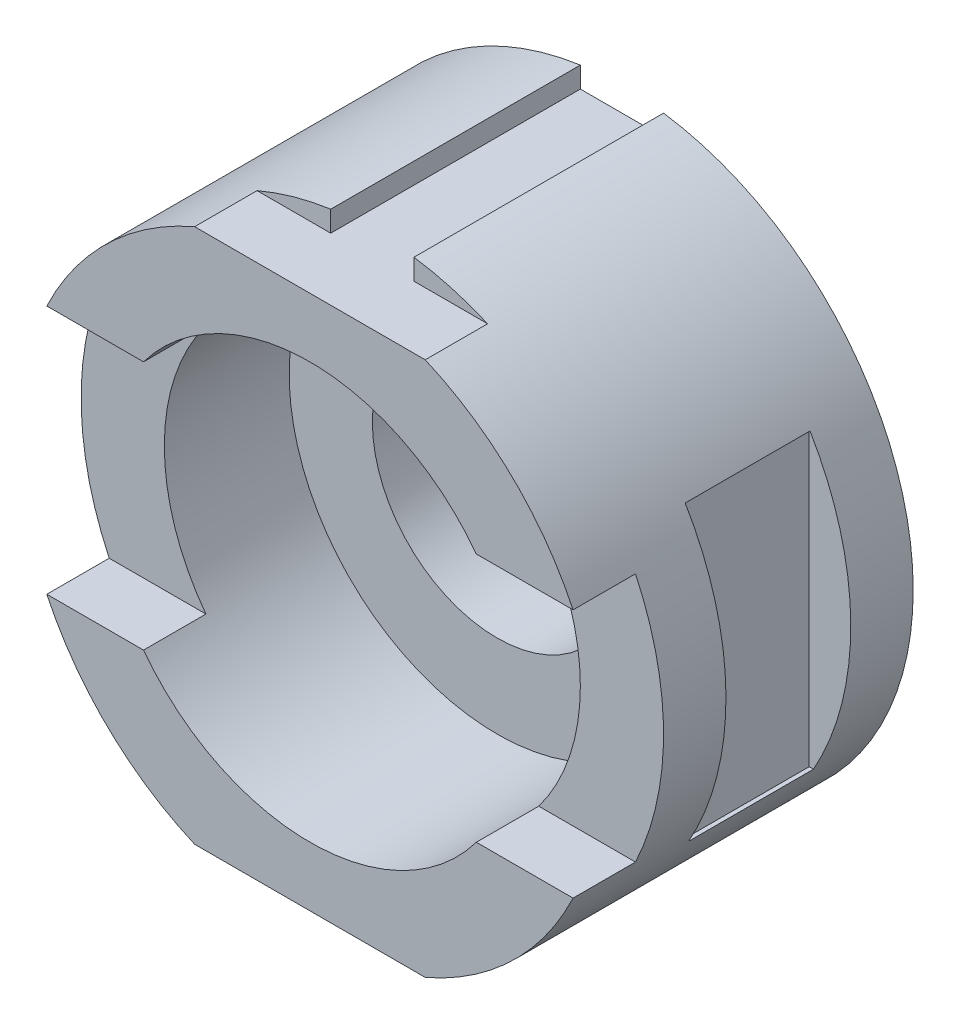
ISO-10303-21;
HEADER;
FILE_DESCRIPTION(('STEP AP214'),'2;1');
FILE_NAME('part.step','',(''),(''),'','','');
FILE_SCHEMA(('AUTOMOTIVE_DESIGN { 1 0 10303 214 1 1 1 1 }'));
ENDSEC;
DATA;
#1=APPLICATION_CONTEXT('core data for automotive mechanical design processes');
#2=APPLICATION_PROTOCOL_DEFINITION('international standard','automotive_design',2000,#1);
#3=PRODUCT_CONTEXT('',#1,'mechanical');
#4=PRODUCT('Part','Part','',(#3));
#5=PRODUCT_RELATED_PRODUCT_CATEGORY('part','',(#4));
#6=PRODUCT_DEFINITION_FORMATION('','',#4);
#7=PRODUCT_DEFINITION_CONTEXT('part definition',#1,'design');
#8=PRODUCT_DEFINITION('design','',#6,#7);
#9=PRODUCT_DEFINITION_SHAPE('','',#8);
#10=(LENGTH_UNIT() NAMED_UNIT(*) SI_UNIT(.MILLI.,.METRE.));
#11=(NAMED_UNIT(*) PLANE_ANGLE_UNIT() SI_UNIT($,.RADIAN.));
#12=(NAMED_UNIT(*) SI_UNIT($,.STERADIAN.) SOLID_ANGLE_UNIT());
#13=UNCERTAINTY_MEASURE_WITH_UNIT(LENGTH_MEASURE(1.E-05),#10,'distance_accuracy_value','');
#14=(GEOMETRIC_REPRESENTATION_CONTEXT(3) GLOBAL_UNCERTAINTY_ASSIGNED_CONTEXT((#13)) GLOBAL_UNIT_ASSIGNED_CONTEXT((#10,
#11,#12)) REPRESENTATION_CONTEXT('',''));
#15=CARTESIAN_POINT('',(0.,0.,0.));
#16=DIRECTION('',(0.,0.,1.));
#17=DIRECTION('',(1.,0.,0.));
#18=AXIS2_PLACEMENT_3D('',#15,#16,#17);
#19=CARTESIAN_POINT('',(0.,0.,0.));
#20=DIRECTION('',(0.,0.,1.));
#21=DIRECTION('',(1.,0.,0.));
#22=AXIS2_PLACEMENT_3D('',#19,#20,#21);
#23=CYLINDRICAL_SURFACE('',#22,30.);
#24=CARTESIAN_POINT('',(0.,0.,0.));
#25=DIRECTION('',(0.,0.,1.));
#26=DIRECTION('',(1.,0.,0.));
#27=AXIS2_PLACEMENT_3D('',#24,#25,#26);
#28=CIRCLE('',#27,30.);
#29=CARTESIAN_POINT('',(30.,0.,0.));
#30=VERTEX_POINT('',#29);
#31=EDGE_CURVE('E399',#30,#30,#28,.T.);
#32=ORIENTED_EDGE('',*,*,#31,.F.);
#33=EDGE_LOOP('',(#32));
#34=FACE_BOUND('',#33,.T.);
#35=CARTESIAN_POINT('',(0.,0.,30.));
#36=DIRECTION('',(0.,0.,1.));
#37=DIRECTION('',(1.,0.,0.));
#38=AXIS2_PLACEMENT_3D('',#35,#36,#37);
#39=CIRCLE('',#38,30.);
#40=CARTESIAN_POINT('',(30.,0.,30.));
#41=VERTEX_POINT('',#40);
#42=EDGE_CURVE('E61',#41,#41,#39,.F.);
#43=ORIENTED_EDGE('',*,*,#42,.F.);
#44=EDGE_LOOP('',(#43));
#45=FACE_BOUND('',#44,.T.);
#46=ADVANCED_FACE('F57',(#34,#45),#23,.F.);
#47=CARTESIAN_POINT('',(0.,-30.,60.));
#48=DIRECTION('',(0.,1.,0.));
#49=DIRECTION('',(-1.,0.,0.));
#50=AXIS2_PLACEMENT_3D('',#47,#48,#49);
#51=PLANE('',#50);
#52=DIRECTION('',(0.,0.,1.));
#53=VECTOR('',#52,1.);
#54=CARTESIAN_POINT('',(-40.,-30.,30.));
#55=LINE('',#54,#53);
#56=CARTESIAN_POINT('',(-40.,-30.,60.));
#57=VERTEX_POINT('',#56);
#58=CARTESIAN_POINT('',(-40.,-30.,75.));
#59=VERTEX_POINT('',#58);
#60=EDGE_CURVE('E572',#57,#59,#55,.T.);
#61=ORIENTED_EDGE('',*,*,#60,.F.);
#62=DIRECTION('',(-1.,0.,0.));
#63=VECTOR('',#62,1.);
#64=CARTESIAN_POINT('',(0.,-30.,60.));
#65=LINE('',#64,#63);
#66=CARTESIAN_POINT('',(-63.2455532033676,-30.,60.));
#67=VERTEX_POINT('',#66);
#68=EDGE_CURVE('E265',#57,#67,#65,.T.);
#69=ORIENTED_EDGE('',*,*,#68,.T.);
#70=DIRECTION('',(0.,0.,1.));
#71=VECTOR('',#70,1.);
#72=CARTESIAN_POINT('',(-63.2455532033676,-30.,60.));
#73=LINE('',#72,#71);
#74=CARTESIAN_POINT('',(-63.2455532033676,-30.,75.));
#75=VERTEX_POINT('',#74);
#76=EDGE_CURVE('E273',#67,#75,#73,.T.);
#77=ORIENTED_EDGE('',*,*,#76,.T.);
#78=DIRECTION('',(-1.,0.,0.));
#79=VECTOR('',#78,1.);
#80=CARTESIAN_POINT('',(0.,-30.,75.));
#81=LINE('',#80,#79);
#82=EDGE_CURVE('E524',#59,#75,#81,.T.);
#83=ORIENTED_EDGE('',*,*,#82,.F.);
#84=EDGE_LOOP('',(#61,#69,#77,#83));
#85=FACE_BOUND('',#84,.T.);
#86=ADVANCED_FACE('F465',(#85),#51,.T.);
#87=CARTESIAN_POINT('',(0.,30.,60.));
#88=DIRECTION('',(0.,1.,0.));
#89=DIRECTION('',(-1.,0.,0.));
#90=AXIS2_PLACEMENT_3D('',#87,#88,#89);
#91=PLANE('',#90);
#92=DIRECTION('',(-1.,0.,0.));
#93=VECTOR('',#92,1.);
#94=CARTESIAN_POINT('',(0.,30.,60.));
#95=LINE('',#94,#93);
#96=CARTESIAN_POINT('',(-40.,30.,60.));
#97=VERTEX_POINT('',#96);
#98=CARTESIAN_POINT('',(-63.2455532033676,30.,60.));
#99=VERTEX_POINT('',#98);
#100=EDGE_CURVE('E267',#97,#99,#95,.T.);
#101=ORIENTED_EDGE('',*,*,#100,.F.);
#102=DIRECTION('',(0.,0.,1.));
#103=VECTOR('',#102,1.);
#104=CARTESIAN_POINT('',(-40.,30.,30.));
#105=LINE('',#104,#103);
#106=CARTESIAN_POINT('',(-40.,30.,75.));
#107=VERTEX_POINT('',#106);
#108=EDGE_CURVE('E570',#97,#107,#105,.T.);
#109=ORIENTED_EDGE('',*,*,#108,.T.);
#110=DIRECTION('',(-1.,0.,0.));
#111=VECTOR('',#110,1.);
#112=CARTESIAN_POINT('',(0.,30.,75.));
#113=LINE('',#112,#111);
#114=CARTESIAN_POINT('',(-63.2455532033676,30.,75.));
#115=VERTEX_POINT('',#114);
#116=EDGE_CURVE('E258',#107,#115,#113,.T.);
#117=ORIENTED_EDGE('',*,*,#116,.T.);
#118=DIRECTION('',(0.,0.,1.));
#119=VECTOR('',#118,1.);
#120=CARTESIAN_POINT('',(-63.2455532033676,30.,60.));
#121=LINE('',#120,#119);
#122=EDGE_CURVE('E277',#99,#115,#121,.T.);
#123=ORIENTED_EDGE('',*,*,#122,.F.);
#124=EDGE_LOOP('',(#101,#109,#117,#123));
#125=FACE_BOUND('',#124,.T.);
#126=ADVANCED_FACE('F471',(#125),#91,.F.);
#127=CARTESIAN_POINT('',(0.,0.,75.));
#128=DIRECTION('',(0.,0.,1.));
#129=DIRECTION('',(1.,0.,0.));
#130=AXIS2_PLACEMENT_3D('',#127,#128,#129);
#131=PLANE('',#130);
#132=CARTESIAN_POINT('',(0.,0.,75.));
#133=DIRECTION('',(0.,0.,1.));
#134=DIRECTION('',(1.,0.,0.));
#135=AXIS2_PLACEMENT_3D('',#132,#133,#134);
#136=CIRCLE('',#135,50.);
#137=CARTESIAN_POINT('',(40.,30.,75.));
#138=VERTEX_POINT('',#137);
#139=EDGE_CURVE('E245',#138,#107,#136,.T.);
#140=ORIENTED_EDGE('',*,*,#139,.F.);
#141=CARTESIAN_POINT('',(63.2455532033676,30.,75.));
#142=VERTEX_POINT('',#141);
#143=EDGE_CURVE('E255',#142,#138,#113,.T.);
#144=ORIENTED_EDGE('',*,*,#143,.F.);
#145=CARTESIAN_POINT('',(0.,0.,75.));
#146=DIRECTION('',(0.,0.,1.));
#147=DIRECTION('',(1.,0.,0.));
#148=AXIS2_PLACEMENT_3D('',#145,#146,#147);
#149=CIRCLE('',#148,70.);
#150=CARTESIAN_POINT('',(27.7095709643356,64.2820323027551,75.));
#151=VERTEX_POINT('',#150);
#152=EDGE_CURVE('E408',#142,#151,#149,.T.);
#153=ORIENTED_EDGE('',*,*,#152,.T.);
#154=DIRECTION('',(1.,0.,0.));
#155=VECTOR('',#154,1.);
#156=CARTESIAN_POINT('',(24.9999999999999,64.2820323027551,75.));
#157=LINE('',#156,#155);
#158=CARTESIAN_POINT('',(-27.7095709643356,64.2820323027551,75.));
#159=VERTEX_POINT('',#158);
#160=EDGE_CURVE('E342',#159,#151,#157,.T.);
#161=ORIENTED_EDGE('',*,*,#160,.F.);
#162=EDGE_CURVE('E404',#159,#115,#149,.T.);
#163=ORIENTED_EDGE('',*,*,#162,.T.);
#164=ORIENTED_EDGE('',*,*,#116,.F.);
#165=EDGE_LOOP('',(#140,#144,#153,#161,#163,#164));
#166=FACE_BOUND('',#165,.T.);
#167=ADVANCED_FACE('F254',(#166),#131,.T.);
#168=CARTESIAN_POINT('',(0.,0.,75.));
#169=DIRECTION('',(0.,0.,-1.));
#170=DIRECTION('',(-1.,0.,0.));
#171=AXIS2_PLACEMENT_3D('',#168,#169,#170);
#172=CYLINDRICAL_SURFACE('',#171,70.);
#173=CARTESIAN_POINT('',(0.,0.,45.));
#174=DIRECTION('',(0.,0.,-1.));
#175=DIRECTION('',(0.,1.,0.));
#176=AXIS2_PLACEMENT_3D('',#173,#174,#175);
#177=CIRCLE('',#176,70.);
#178=CARTESIAN_POINT('',(60.2015513386372,35.7179676972449,45.));
#179=VERTEX_POINT('',#178);
#180=CARTESIAN_POINT('',(61.0306665635634,-34.2820323027551,45.));
#181=VERTEX_POINT('',#180);
#182=EDGE_CURVE('E66',#179,#181,#177,.T.);
#183=ORIENTED_EDGE('',*,*,#182,.F.);
#184=DIRECTION('',(0.,0.,-1.));
#185=VECTOR('',#184,1.);
#186=CARTESIAN_POINT('',(60.2015513386372,35.7179676972449,75.));
#187=LINE('',#186,#185);
#188=CARTESIAN_POINT('',(60.2015513386372,35.7179676972449,15.));
#189=VERTEX_POINT('',#188);
#190=EDGE_CURVE('E424',#189,#179,#187,.F.);
#191=ORIENTED_EDGE('',*,*,#190,.F.);
#192=CARTESIAN_POINT('',(0.,0.,15.));
#193=DIRECTION('',(0.,0.,1.));
#194=DIRECTION('',(0.,-1.,0.));
#195=AXIS2_PLACEMENT_3D('',#192,#193,#194);
#196=CIRCLE('',#195,70.);
#197=CARTESIAN_POINT('',(61.0306665635634,-34.2820323027551,15.));
#198=VERTEX_POINT('',#197);
#199=EDGE_CURVE('E426',#198,#189,#196,.T.);
#200=ORIENTED_EDGE('',*,*,#199,.F.);
#201=DIRECTION('',(0.,0.,-1.));
#202=VECTOR('',#201,1.);
#203=CARTESIAN_POINT('',(61.0306665635634,-34.2820323027551,75.));
#204=LINE('',#203,#202);
#205=EDGE_CURVE('E429',#181,#198,#204,.T.);
#206=ORIENTED_EDGE('',*,*,#205,.F.);
#207=EDGE_LOOP('',(#183,#191,#200,#206));
#208=FACE_BOUND('',#207,.T.);
#209=DIRECTION('',(0.,0.,1.));
#210=VECTOR('',#209,1.);
#211=CARTESIAN_POINT('',(63.2455532033676,30.,60.));
#212=LINE('',#211,#210);
#213=CARTESIAN_POINT('',(63.2455532033676,30.,60.));
#214=VERTEX_POINT('',#213);
#215=EDGE_CURVE('E263',#214,#142,#212,.T.);
#216=ORIENTED_EDGE('',*,*,#215,.F.);
#217=CARTESIAN_POINT('',(0.,0.,60.));
#218=DIRECTION('',(0.,0.,1.));
#219=DIRECTION('',(1.,0.,0.));
#220=AXIS2_PLACEMENT_3D('',#217,#218,#219);
#221=CIRCLE('',#220,70.);
#222=CARTESIAN_POINT('',(63.2455532033676,-30.,60.));
#223=VERTEX_POINT('',#222);
#224=EDGE_CURVE('E585',#223,#214,#221,.T.);
#225=ORIENTED_EDGE('',*,*,#224,.F.);
#226=DIRECTION('',(0.,0.,1.));
#227=VECTOR('',#226,1.);
#228=CARTESIAN_POINT('',(63.2455532033676,-30.,60.));
#229=LINE('',#228,#227);
#230=CARTESIAN_POINT('',(63.2455532033676,-30.,75.));
#231=VERTEX_POINT('',#230);
#232=EDGE_CURVE('E579',#223,#231,#229,.T.);
#233=ORIENTED_EDGE('',*,*,#232,.T.);
#234=CARTESIAN_POINT('',(27.7095709643356,-64.2820323027551,75.));
#235=VERTEX_POINT('',#234);
#236=EDGE_CURVE('E409',#235,#231,#149,.T.);
#237=ORIENTED_EDGE('',*,*,#236,.F.);
#238=DIRECTION('',(0.,0.,-1.));
#239=VECTOR('',#238,1.);
#240=CARTESIAN_POINT('',(27.7095709643356,-64.2820323027551,75.));
#241=LINE('',#240,#239);
#242=CARTESIAN_POINT('',(27.7095709643356,-64.2820323027551,60.));
#243=VERTEX_POINT('',#242);
#244=EDGE_CURVE('E283',#235,#243,#241,.T.);
#245=ORIENTED_EDGE('',*,*,#244,.T.);
#246=CARTESIAN_POINT('',(0.,0.,60.));
#247=DIRECTION('',(0.,0.,-1.));
#248=DIRECTION('',(-1.,0.,0.));
#249=AXIS2_PLACEMENT_3D('',#246,#247,#248);
#250=CIRCLE('',#249,70.);
#251=CARTESIAN_POINT('',(10.0000000000001,-69.2820323027551,60.));
#252=VERTEX_POINT('',#251);
#253=EDGE_CURVE('E311',#243,#252,#250,.T.);
#254=ORIENTED_EDGE('',*,*,#253,.T.);
#255=DIRECTION('',(0.,0.,1.));
#256=VECTOR('',#255,1.);
#257=CARTESIAN_POINT('',(9.99999999999993,-69.2820323027551,0.));
#258=LINE('',#257,#256);
#259=CARTESIAN_POINT('',(10.0000000000001,-69.2820323027551,0.));
#260=VERTEX_POINT('',#259);
#261=EDGE_CURVE('E385',#260,#252,#258,.T.);
#262=ORIENTED_EDGE('',*,*,#261,.F.);
#263=CARTESIAN_POINT('',(0.,0.,0.));
#264=DIRECTION('',(0.,0.,1.));
#265=DIRECTION('',(1.,0.,0.));
#266=AXIS2_PLACEMENT_3D('',#263,#264,#265);
#267=CIRCLE('',#266,70.);
#268=CARTESIAN_POINT('',(9.99999999999993,69.2820323027551,0.));
#269=VERTEX_POINT('',#268);
#270=EDGE_CURVE('E403',#260,#269,#267,.T.);
#271=ORIENTED_EDGE('',*,*,#270,.T.);
#272=DIRECTION('',(0.,0.,1.));
#273=VECTOR('',#272,1.);
#274=CARTESIAN_POINT('',(9.99999999999993,69.2820323027551,0.));
#275=LINE('',#274,#273);
#276=CARTESIAN_POINT('',(9.99999999999993,69.2820323027551,60.));
#277=VERTEX_POINT('',#276);
#278=EDGE_CURVE('E396',#269,#277,#275,.T.);
#279=ORIENTED_EDGE('',*,*,#278,.T.);
#280=CARTESIAN_POINT('',(0.,0.,60.));
#281=DIRECTION('',(0.,0.,-1.));
#282=DIRECTION('',(-1.,0.,0.));
#283=AXIS2_PLACEMENT_3D('',#280,#281,#282);
#284=CIRCLE('',#283,70.);
#285=CARTESIAN_POINT('',(27.7095709643356,64.2820323027551,60.));
#286=VERTEX_POINT('',#285);
#287=EDGE_CURVE('E348',#277,#286,#284,.T.);
#288=ORIENTED_EDGE('',*,*,#287,.T.);
#289=DIRECTION('',(0.,0.,-1.));
#290=VECTOR('',#289,1.);
#291=CARTESIAN_POINT('',(27.7095709643356,64.2820323027551,75.));
#292=LINE('',#291,#290);
#293=EDGE_CURVE('E314',#286,#151,#292,.F.);
#294=ORIENTED_EDGE('',*,*,#293,.T.);
#295=ORIENTED_EDGE('',*,*,#152,.F.);
#296=EDGE_LOOP('',(#216,#225,#233,#237,#245,#254,#262,#271,#279,#288,#294,#295));
#297=FACE_BOUND('',#296,.T.);
#298=ADVANCED_FACE('F445',(#208,#297),#172,.T.);
#299=DIRECTION('',(0.,0.,-1.));
#300=VECTOR('',#299,1.);
#301=CARTESIAN_POINT('',(-61.0306665635634,-34.2820323027551,75.));
#302=LINE('',#301,#300);
#303=CARTESIAN_POINT('',(-61.0306665635634,-34.2820323027551,45.));
#304=VERTEX_POINT('',#303);
#305=CARTESIAN_POINT('',(-61.0306665635634,-34.2820323027551,15.));
#306=VERTEX_POINT('',#305);
#307=EDGE_CURVE('E418',#304,#306,#302,.T.);
#308=ORIENTED_EDGE('',*,*,#307,.T.);
#309=CARTESIAN_POINT('',(0.,0.,15.));
#310=DIRECTION('',(0.,0.,-1.));
#311=DIRECTION('',(0.,1.,0.));
#312=AXIS2_PLACEMENT_3D('',#309,#310,#311);
#313=CIRCLE('',#312,70.);
#314=CARTESIAN_POINT('',(-60.2015513386372,35.7179676972449,15.));
#315=VERTEX_POINT('',#314);
#316=EDGE_CURVE('E421',#306,#315,#313,.T.);
#317=ORIENTED_EDGE('',*,*,#316,.T.);
#318=DIRECTION('',(0.,0.,-1.));
#319=VECTOR('',#318,1.);
#320=CARTESIAN_POINT('',(-60.2015513386372,35.7179676972449,75.));
#321=LINE('',#320,#319);
#322=CARTESIAN_POINT('',(-60.2015513386372,35.7179676972449,45.));
#323=VERTEX_POINT('',#322);
#324=EDGE_CURVE('E406',#315,#323,#321,.F.);
#325=ORIENTED_EDGE('',*,*,#324,.T.);
#326=CARTESIAN_POINT('',(0.,0.,45.));
#327=DIRECTION('',(0.,0.,1.));
#328=DIRECTION('',(0.,-1.,0.));
#329=AXIS2_PLACEMENT_3D('',#326,#327,#328);
#330=CIRCLE('',#329,70.);
#331=EDGE_CURVE('E415',#323,#304,#330,.T.);
#332=ORIENTED_EDGE('',*,*,#331,.T.);
#333=EDGE_LOOP('',(#308,#317,#325,#332));
#334=FACE_BOUND('',#333,.T.);
#335=ORIENTED_EDGE('',*,*,#76,.F.);
#336=CARTESIAN_POINT('',(0.,0.,60.));
#337=DIRECTION('',(0.,0.,1.));
#338=DIRECTION('',(1.,0.,0.));
#339=AXIS2_PLACEMENT_3D('',#336,#337,#338);
#340=CIRCLE('',#339,70.);
#341=EDGE_CURVE('E280',#99,#67,#340,.T.);
#342=ORIENTED_EDGE('',*,*,#341,.F.);
#343=ORIENTED_EDGE('',*,*,#122,.T.);
#344=ORIENTED_EDGE('',*,*,#162,.F.);
#345=DIRECTION('',(0.,0.,-1.));
#346=VECTOR('',#345,1.);
#347=CARTESIAN_POINT('',(-27.7095709643356,64.2820323027551,75.));
#348=LINE('',#347,#346);
#349=CARTESIAN_POINT('',(-27.7095709643356,64.2820323027551,60.));
#350=VERTEX_POINT('',#349);
#351=EDGE_CURVE('E317',#159,#350,#348,.T.);
#352=ORIENTED_EDGE('',*,*,#351,.T.);
#353=CARTESIAN_POINT('',(0.,0.,60.));
#354=DIRECTION('',(0.,0.,-1.));
#355=DIRECTION('',(-1.,0.,0.));
#356=AXIS2_PLACEMENT_3D('',#353,#354,#355);
#357=CIRCLE('',#356,70.);
#358=CARTESIAN_POINT('',(-9.99999999999993,69.2820323027551,60.));
#359=VERTEX_POINT('',#358);
#360=EDGE_CURVE('E345',#350,#359,#357,.T.);
#361=ORIENTED_EDGE('',*,*,#360,.T.);
#362=DIRECTION('',(0.,0.,1.));
#363=VECTOR('',#362,1.);
#364=CARTESIAN_POINT('',(-9.99999999999993,69.2820323027551,0.));
#365=LINE('',#364,#363);
#366=CARTESIAN_POINT('',(-9.99999999999993,69.2820323027551,0.));
#367=VERTEX_POINT('',#366);
#368=EDGE_CURVE('E394',#367,#359,#365,.T.);
#369=ORIENTED_EDGE('',*,*,#368,.F.);
#370=CARTESIAN_POINT('',(-9.99999999999993,-69.2820323027551,0.));
#371=VERTEX_POINT('',#370);
#372=EDGE_CURVE('E410',#367,#371,#267,.T.);
#373=ORIENTED_EDGE('',*,*,#372,.T.);
#374=DIRECTION('',(0.,0.,1.));
#375=VECTOR('',#374,1.);
#376=CARTESIAN_POINT('',(-9.99999999999993,-69.2820323027551,0.));
#377=LINE('',#376,#375);
#378=CARTESIAN_POINT('',(-9.99999999999993,-69.2820323027551,60.));
#379=VERTEX_POINT('',#378);
#380=EDGE_CURVE('E391',#371,#379,#377,.T.);
#381=ORIENTED_EDGE('',*,*,#380,.T.);
#382=CARTESIAN_POINT('',(0.,0.,60.));
#383=DIRECTION('',(0.,0.,-1.));
#384=DIRECTION('',(-1.,0.,0.));
#385=AXIS2_PLACEMENT_3D('',#382,#383,#384);
#386=CIRCLE('',#385,70.);
#387=CARTESIAN_POINT('',(-27.7095709643356,-64.2820323027551,60.));
#388=VERTEX_POINT('',#387);
#389=EDGE_CURVE('E309',#379,#388,#386,.T.);
#390=ORIENTED_EDGE('',*,*,#389,.T.);
#391=DIRECTION('',(0.,0.,-1.));
#392=VECTOR('',#391,1.);
#393=CARTESIAN_POINT('',(-27.7095709643356,-64.2820323027551,75.));
#394=LINE('',#393,#392);
#395=CARTESIAN_POINT('',(-27.7095709643356,-64.2820323027551,75.));
#396=VERTEX_POINT('',#395);
#397=EDGE_CURVE('E276',#388,#396,#394,.F.);
#398=ORIENTED_EDGE('',*,*,#397,.T.);
#399=EDGE_CURVE('E407',#75,#396,#149,.T.);
#400=ORIENTED_EDGE('',*,*,#399,.F.);
#401=EDGE_LOOP('',(#335,#342,#343,#344,#352,#361,#369,#373,#381,#390,#398,#400));
#402=FACE_BOUND('',#401,.T.);
#403=ADVANCED_FACE('F59',(#334,#402),#172,.T.);
#404=CARTESIAN_POINT('',(40.,-30.,75.));
#405=VERTEX_POINT('',#404);
#406=EDGE_CURVE('E259',#59,#405,#136,.T.);
#407=ORIENTED_EDGE('',*,*,#406,.F.);
#408=ORIENTED_EDGE('',*,*,#82,.T.);
#409=ORIENTED_EDGE('',*,*,#399,.T.);
#410=DIRECTION('',(-1.,0.,0.));
#411=VECTOR('',#410,1.);
#412=CARTESIAN_POINT('',(-24.9999999999999,-64.2820323027551,75.));
#413=LINE('',#412,#411);
#414=EDGE_CURVE('E306',#235,#396,#413,.T.);
#415=ORIENTED_EDGE('',*,*,#414,.F.);
#416=ORIENTED_EDGE('',*,*,#236,.T.);
#417=EDGE_CURVE('E269',#231,#405,#81,.T.);
#418=ORIENTED_EDGE('',*,*,#417,.T.);
#419=EDGE_LOOP('',(#407,#408,#409,#415,#416,#418));
#420=FACE_BOUND('',#419,.T.);
#421=ADVANCED_FACE('F481',(#420),#131,.T.);
#422=CARTESIAN_POINT('',(-24.9999999999999,-64.2820323027551,60.));
#423=DIRECTION('',(0.,0.,-1.));
#424=DIRECTION('',(-1.,0.,0.));
#425=AXIS2_PLACEMENT_3D('',#422,#423,#424);
#426=PLANE('',#425);
#427=ORIENTED_EDGE('',*,*,#389,.F.);
#428=DIRECTION('',(0.,-1.,0.));
#429=VECTOR('',#428,1.);
#430=CARTESIAN_POINT('',(-9.99999999999993,-69.2820323027551,60.));
#431=LINE('',#430,#429);
#432=CARTESIAN_POINT('',(-9.99999999999993,-64.2820323027551,60.));
#433=VERTEX_POINT('',#432);
#434=EDGE_CURVE('E286',#433,#379,#431,.T.);
#435=ORIENTED_EDGE('',*,*,#434,.F.);
#436=DIRECTION('',(1.,0.,0.));
#437=VECTOR('',#436,1.);
#438=CARTESIAN_POINT('',(-24.9999999999999,-64.2820323027551,60.));
#439=LINE('',#438,#437);
#440=EDGE_CURVE('E303',#388,#433,#439,.T.);
#441=ORIENTED_EDGE('',*,*,#440,.F.);
#442=EDGE_LOOP('',(#427,#435,#441));
#443=FACE_BOUND('',#442,.T.);
#444=ADVANCED_FACE('F483',(#443),#426,.F.);
#445=CARTESIAN_POINT('',(24.9999999999999,64.2820323027551,60.));
#446=DIRECTION('',(0.,0.,-1.));
#447=DIRECTION('',(-1.,0.,0.));
#448=AXIS2_PLACEMENT_3D('',#445,#446,#447);
#449=PLANE('',#448);
#450=ORIENTED_EDGE('',*,*,#287,.F.);
#451=DIRECTION('',(-0.0143344091330068,0.99989725707935,0.));
#452=VECTOR('',#451,1.);
#453=CARTESIAN_POINT('',(10.0716794102169,64.2820323027551,60.));
#454=LINE('',#453,#452);
#455=CARTESIAN_POINT('',(10.0716794102169,64.2820323027551,60.));
#456=VERTEX_POINT('',#455);
#457=EDGE_CURVE('E322',#456,#277,#454,.T.);
#458=ORIENTED_EDGE('',*,*,#457,.F.);
#459=DIRECTION('',(-1.,0.,0.));
#460=VECTOR('',#459,1.);
#461=CARTESIAN_POINT('',(24.9999999999999,64.2820323027551,60.));
#462=LINE('',#461,#460);
#463=EDGE_CURVE('E339',#286,#456,#462,.T.);
#464=ORIENTED_EDGE('',*,*,#463,.F.);
#465=EDGE_LOOP('',(#450,#458,#464));
#466=FACE_BOUND('',#465,.T.);
#467=ADVANCED_FACE('F487',(#466),#449,.F.);
#468=CARTESIAN_POINT('',(0.,0.,0.));
#469=DIRECTION('',(0.,0.,1.));
#470=DIRECTION('',(1.,0.,0.));
#471=AXIS2_PLACEMENT_3D('',#468,#469,#470);
#472=PLANE('',#471);
#473=ORIENTED_EDGE('',*,*,#31,.T.);
#474=EDGE_LOOP('',(#473));
#475=FACE_BOUND('',#474,.T.);
#476=DIRECTION('',(-1.,0.,0.));
#477=VECTOR('',#476,1.);
#478=CARTESIAN_POINT('',(0.,-64.2820323027551,0.));
#479=LINE('',#478,#477);
#480=CARTESIAN_POINT('',(10.0000000000001,-64.2820323027551,0.));
#481=VERTEX_POINT('',#480);
#482=CARTESIAN_POINT('',(-9.99999999999993,-64.2820323027551,0.));
#483=VERTEX_POINT('',#482);
#484=EDGE_CURVE('E296',#481,#483,#479,.T.);
#485=ORIENTED_EDGE('',*,*,#484,.T.);
#486=DIRECTION('',(0.,-1.,0.));
#487=VECTOR('',#486,1.);
#488=CARTESIAN_POINT('',(-9.99999999999993,0.,0.));
#489=LINE('',#488,#487);
#490=EDGE_CURVE('E299',#483,#371,#489,.T.);
#491=ORIENTED_EDGE('',*,*,#490,.T.);
#492=ORIENTED_EDGE('',*,*,#372,.F.);
#493=DIRECTION('',(0.,-1.,0.));
#494=VECTOR('',#493,1.);
#495=CARTESIAN_POINT('',(-9.99999999999993,0.,0.));
#496=LINE('',#495,#494);
#497=CARTESIAN_POINT('',(-9.99999999999993,64.2820323027551,0.));
#498=VERTEX_POINT('',#497);
#499=EDGE_CURVE('E327',#367,#498,#496,.T.);
#500=ORIENTED_EDGE('',*,*,#499,.T.);
#501=DIRECTION('',(1.,0.,0.));
#502=VECTOR('',#501,1.);
#503=CARTESIAN_POINT('',(0.,64.2820323027551,0.));
#504=LINE('',#503,#502);
#505=CARTESIAN_POINT('',(10.0716794102169,64.2820323027551,0.));
#506=VERTEX_POINT('',#505);
#507=EDGE_CURVE('E332',#498,#506,#504,.T.);
#508=ORIENTED_EDGE('',*,*,#507,.T.);
#509=DIRECTION('',(-0.0143344091330068,0.99989725707935,0.));
#510=VECTOR('',#509,1.);
#511=CARTESIAN_POINT('',(10.9909602080011,0.157565109085586,0.));
#512=LINE('',#511,#510);
#513=EDGE_CURVE('E335',#506,#269,#512,.T.);
#514=ORIENTED_EDGE('',*,*,#513,.T.);
#515=ORIENTED_EDGE('',*,*,#270,.F.);
#516=DIRECTION('',(0.,1.,0.));
#517=VECTOR('',#516,1.);
#518=CARTESIAN_POINT('',(10.,0.,0.));
#519=LINE('',#518,#517);
#520=EDGE_CURVE('E292',#260,#481,#519,.T.);
#521=ORIENTED_EDGE('',*,*,#520,.T.);
#522=EDGE_LOOP('',(#485,#491,#492,#500,#508,#514,#515,#521));
#523=FACE_BOUND('',#522,.T.);
#524=ADVANCED_FACE('F485',(#475,#523),#472,.F.);
#525=CARTESIAN_POINT('',(-135.,35.7179676972449,15.));
#526=DIRECTION('',(0.,0.,-1.));
#527=DIRECTION('',(0.,1.,0.));
#528=AXIS2_PLACEMENT_3D('',#525,#526,#527);
#529=PLANE('',#528);
#530=DIRECTION('',(1.,0.,0.));
#531=VECTOR('',#530,1.);
#532=CARTESIAN_POINT('',(-135.,-34.2820323027551,15.));
#533=LINE('',#532,#531);
#534=CARTESIAN_POINT('',(-60.,-34.2820323027551,15.));
#535=VERTEX_POINT('',#534);
#536=EDGE_CURVE('E383',#306,#535,#533,.T.);
#537=ORIENTED_EDGE('',*,*,#536,.T.);
#538=DIRECTION('',(0.,1.,0.));
#539=VECTOR('',#538,1.);
#540=CARTESIAN_POINT('',(-60.,35.7179676972449,15.));
#541=LINE('',#540,#539);
#542=CARTESIAN_POINT('',(-60.,35.7179676972449,15.));
#543=VERTEX_POINT('',#542);
#544=EDGE_CURVE('E370',#535,#543,#541,.T.);
#545=ORIENTED_EDGE('',*,*,#544,.T.);
#546=DIRECTION('',(1.,0.,0.));
#547=VECTOR('',#546,1.);
#548=CARTESIAN_POINT('',(-135.,35.7179676972449,15.));
#549=LINE('',#548,#547);
#550=EDGE_CURVE('E382',#315,#543,#549,.T.);
#551=ORIENTED_EDGE('',*,*,#550,.F.);
#552=ORIENTED_EDGE('',*,*,#316,.F.);
#553=EDGE_LOOP('',(#537,#545,#551,#552));
#554=FACE_BOUND('',#553,.T.);
#555=ADVANCED_FACE('F479',(#554),#529,.F.);
#556=CARTESIAN_POINT('',(-135.,-34.2820323027551,15.));
#557=DIRECTION('',(0.,-1.,0.));
#558=DIRECTION('',(0.,0.,-1.));
#559=AXIS2_PLACEMENT_3D('',#556,#557,#558);
#560=PLANE('',#559);
#561=DIRECTION('',(1.,0.,0.));
#562=VECTOR('',#561,1.);
#563=CARTESIAN_POINT('',(-135.,-34.2820323027551,45.));
#564=LINE('',#563,#562);
#565=CARTESIAN_POINT('',(-60.,-34.2820323027551,45.));
#566=VERTEX_POINT('',#565);
#567=EDGE_CURVE('E386',#304,#566,#564,.T.);
#568=ORIENTED_EDGE('',*,*,#567,.T.);
#569=DIRECTION('',(0.,0.,-1.));
#570=VECTOR('',#569,1.);
#571=CARTESIAN_POINT('',(-60.,-34.2820323027551,15.));
#572=LINE('',#571,#570);
#573=EDGE_CURVE('E379',#566,#535,#572,.T.);
#574=ORIENTED_EDGE('',*,*,#573,.T.);
#575=ORIENTED_EDGE('',*,*,#536,.F.);
#576=ORIENTED_EDGE('',*,*,#307,.F.);
#577=EDGE_LOOP('',(#568,#574,#575,#576));
#578=FACE_BOUND('',#577,.T.);
#579=ADVANCED_FACE('F493',(#578),#560,.F.);
#580=CARTESIAN_POINT('',(-135.,35.7179676972449,45.));
#581=DIRECTION('',(0.,0.,1.));
#582=DIRECTION('',(0.,-1.,0.));
#583=AXIS2_PLACEMENT_3D('',#580,#581,#582);
#584=PLANE('',#583);
#585=DIRECTION('',(1.,0.,0.));
#586=VECTOR('',#585,1.);
#587=CARTESIAN_POINT('',(-135.,35.7179676972449,45.));
#588=LINE('',#587,#586);
#589=CARTESIAN_POINT('',(-60.,35.7179676972449,45.));
#590=VERTEX_POINT('',#589);
#591=EDGE_CURVE('E388',#323,#590,#588,.T.);
#592=ORIENTED_EDGE('',*,*,#591,.T.);
#593=DIRECTION('',(0.,-1.,0.));
#594=VECTOR('',#593,1.);
#595=CARTESIAN_POINT('',(-60.,35.7179676972449,45.));
#596=LINE('',#595,#594);
#597=EDGE_CURVE('E376',#590,#566,#596,.T.);
#598=ORIENTED_EDGE('',*,*,#597,.T.);
#599=ORIENTED_EDGE('',*,*,#567,.F.);
#600=ORIENTED_EDGE('',*,*,#331,.F.);
#601=EDGE_LOOP('',(#592,#598,#599,#600));
#602=FACE_BOUND('',#601,.T.);
#603=ADVANCED_FACE('F753',(#602),#584,.F.);
#604=CARTESIAN_POINT('',(-135.,35.7179676972449,15.));
#605=DIRECTION('',(0.,1.,0.));
#606=DIRECTION('',(0.,0.,1.));
#607=AXIS2_PLACEMENT_3D('',#604,#605,#606);
#608=PLANE('',#607);
#609=ORIENTED_EDGE('',*,*,#550,.T.);
#610=DIRECTION('',(0.,0.,1.));
#611=VECTOR('',#610,1.);
#612=CARTESIAN_POINT('',(-60.,35.7179676972449,15.));
#613=LINE('',#612,#611);
#614=EDGE_CURVE('E373',#543,#590,#613,.T.);
#615=ORIENTED_EDGE('',*,*,#614,.T.);
#616=ORIENTED_EDGE('',*,*,#591,.F.);
#617=ORIENTED_EDGE('',*,*,#324,.F.);
#618=EDGE_LOOP('',(#609,#615,#616,#617));
#619=FACE_BOUND('',#618,.T.);
#620=ADVANCED_FACE('F762',(#619),#608,.F.);
#621=CARTESIAN_POINT('',(-60.,0.,0.));
#622=DIRECTION('',(-1.,0.,0.));
#623=DIRECTION('',(0.,0.,1.));
#624=AXIS2_PLACEMENT_3D('',#621,#622,#623);
#625=PLANE('',#624);
#626=ORIENTED_EDGE('',*,*,#544,.F.);
#627=ORIENTED_EDGE('',*,*,#573,.F.);
#628=ORIENTED_EDGE('',*,*,#597,.F.);
#629=ORIENTED_EDGE('',*,*,#614,.F.);
#630=EDGE_LOOP('',(#626,#627,#628,#629));
#631=FACE_BOUND('',#630,.T.);
#632=ADVANCED_FACE('F759',(#631),#625,.T.);
#633=CARTESIAN_POINT('',(135.,35.7179676972449,45.));
#634=DIRECTION('',(0.,0.,-1.));
#635=DIRECTION('',(0.,1.,0.));
#636=AXIS2_PLACEMENT_3D('',#633,#634,#635);
#637=PLANE('',#636);
#638=ORIENTED_EDGE('',*,*,#182,.T.);
#639=DIRECTION('',(-1.,0.,0.));
#640=VECTOR('',#639,1.);
#641=CARTESIAN_POINT('',(135.,-34.2820323027551,45.));
#642=LINE('',#641,#640);
#643=CARTESIAN_POINT('',(60.,-34.2820323027551,45.));
#644=VERTEX_POINT('',#643);
#645=EDGE_CURVE('E368',#181,#644,#642,.T.);
#646=ORIENTED_EDGE('',*,*,#645,.T.);
#647=DIRECTION('',(0.,-1.,0.));
#648=VECTOR('',#647,1.);
#649=CARTESIAN_POINT('',(60.,35.7179676972449,45.));
#650=LINE('',#649,#648);
#651=CARTESIAN_POINT('',(60.,35.7179676972449,45.));
#652=VERTEX_POINT('',#651);
#653=EDGE_CURVE('E350',#652,#644,#650,.T.);
#654=ORIENTED_EDGE('',*,*,#653,.F.);
#655=DIRECTION('',(-1.,0.,0.));
#656=VECTOR('',#655,1.);
#657=CARTESIAN_POINT('',(135.,35.7179676972449,45.));
#658=LINE('',#657,#656);
#659=EDGE_CURVE('E362',#179,#652,#658,.T.);
#660=ORIENTED_EDGE('',*,*,#659,.F.);
#661=EDGE_LOOP('',(#638,#646,#654,#660));
#662=FACE_BOUND('',#661,.T.);
#663=ADVANCED_FACE('F435',(#662),#637,.T.);
#664=CARTESIAN_POINT('',(135.,-34.2820323027551,45.));
#665=DIRECTION('',(0.,1.,0.));
#666=DIRECTION('',(0.,0.,1.));
#667=AXIS2_PLACEMENT_3D('',#664,#665,#666);
#668=PLANE('',#667);
#669=ORIENTED_EDGE('',*,*,#205,.T.);
#670=DIRECTION('',(-1.,0.,0.));
#671=VECTOR('',#670,1.);
#672=CARTESIAN_POINT('',(135.,-34.2820323027551,15.));
#673=LINE('',#672,#671);
#674=CARTESIAN_POINT('',(60.,-34.2820323027551,15.));
#675=VERTEX_POINT('',#674);
#676=EDGE_CURVE('E366',#198,#675,#673,.T.);
#677=ORIENTED_EDGE('',*,*,#676,.T.);
#678=DIRECTION('',(0.,0.,-1.));
#679=VECTOR('',#678,1.);
#680=CARTESIAN_POINT('',(60.,-34.2820323027551,45.));
#681=LINE('',#680,#679);
#682=EDGE_CURVE('E353',#644,#675,#681,.T.);
#683=ORIENTED_EDGE('',*,*,#682,.F.);
#684=ORIENTED_EDGE('',*,*,#645,.F.);
#685=EDGE_LOOP('',(#669,#677,#683,#684));
#686=FACE_BOUND('',#685,.T.);
#687=ADVANCED_FACE('F442',(#686),#668,.T.);
#688=CARTESIAN_POINT('',(135.,35.7179676972449,15.));
#689=DIRECTION('',(0.,0.,1.));
#690=DIRECTION('',(0.,-1.,0.));
#691=AXIS2_PLACEMENT_3D('',#688,#689,#690);
#692=PLANE('',#691);
#693=ORIENTED_EDGE('',*,*,#199,.T.);
#694=DIRECTION('',(-1.,0.,0.));
#695=VECTOR('',#694,1.);
#696=CARTESIAN_POINT('',(135.,35.7179676972449,15.));
#697=LINE('',#696,#695);
#698=CARTESIAN_POINT('',(60.,35.7179676972449,15.));
#699=VERTEX_POINT('',#698);
#700=EDGE_CURVE('E364',#189,#699,#697,.T.);
#701=ORIENTED_EDGE('',*,*,#700,.T.);
#702=DIRECTION('',(0.,1.,0.));
#703=VECTOR('',#702,1.);
#704=CARTESIAN_POINT('',(60.,35.7179676972449,15.));
#705=LINE('',#704,#703);
#706=EDGE_CURVE('E356',#675,#699,#705,.T.);
#707=ORIENTED_EDGE('',*,*,#706,.F.);
#708=ORIENTED_EDGE('',*,*,#676,.F.);
#709=EDGE_LOOP('',(#693,#701,#707,#708));
#710=FACE_BOUND('',#709,.T.);
#711=ADVANCED_FACE('F448',(#710),#692,.T.);
#712=CARTESIAN_POINT('',(135.,35.7179676972449,45.));
#713=DIRECTION('',(0.,-1.,0.));
#714=DIRECTION('',(0.,0.,-1.));
#715=AXIS2_PLACEMENT_3D('',#712,#713,#714);
#716=PLANE('',#715);
#717=ORIENTED_EDGE('',*,*,#190,.T.);
#718=ORIENTED_EDGE('',*,*,#659,.T.);
#719=DIRECTION('',(0.,0.,1.));
#720=VECTOR('',#719,1.);
#721=CARTESIAN_POINT('',(60.,35.7179676972449,45.));
#722=LINE('',#721,#720);
#723=EDGE_CURVE('E359',#699,#652,#722,.T.);
#724=ORIENTED_EDGE('',*,*,#723,.F.);
#725=ORIENTED_EDGE('',*,*,#700,.F.);
#726=EDGE_LOOP('',(#717,#718,#724,#725));
#727=FACE_BOUND('',#726,.T.);
#728=ADVANCED_FACE('F454',(#727),#716,.T.);
#729=CARTESIAN_POINT('',(60.,0.,0.));
#730=DIRECTION('',(1.,0.,0.));
#731=DIRECTION('',(0.,0.,-1.));
#732=AXIS2_PLACEMENT_3D('',#729,#730,#731);
#733=PLANE('',#732);
#734=ORIENTED_EDGE('',*,*,#653,.T.);
#735=ORIENTED_EDGE('',*,*,#682,.T.);
#736=ORIENTED_EDGE('',*,*,#706,.T.);
#737=ORIENTED_EDGE('',*,*,#723,.T.);
#738=EDGE_LOOP('',(#734,#735,#736,#737));
#739=FACE_BOUND('',#738,.T.);
#740=ADVANCED_FACE('F451',(#739),#733,.T.);
#741=CARTESIAN_POINT('',(-9.99999999999993,64.2820323027551,60.));
#742=VERTEX_POINT('',#741);
#743=EDGE_CURVE('E338',#742,#350,#462,.T.);
#744=ORIENTED_EDGE('',*,*,#743,.F.);
#745=DIRECTION('',(0.,-1.,0.));
#746=VECTOR('',#745,1.);
#747=CARTESIAN_POINT('',(-9.99999999999993,69.2820323027551,60.));
#748=LINE('',#747,#746);
#749=EDGE_CURVE('E320',#359,#742,#748,.T.);
#750=ORIENTED_EDGE('',*,*,#749,.F.);
#751=ORIENTED_EDGE('',*,*,#360,.F.);
#752=EDGE_LOOP('',(#744,#750,#751));
#753=FACE_BOUND('',#752,.T.);
#754=ADVANCED_FACE('F461',(#753),#449,.F.);
#755=CARTESIAN_POINT('',(0.,64.2820323027551,0.));
#756=DIRECTION('',(0.,1.,0.));
#757=DIRECTION('',(0.,0.,1.));
#758=AXIS2_PLACEMENT_3D('',#755,#756,#757);
#759=PLANE('',#758);
#760=ORIENTED_EDGE('',*,*,#160,.T.);
#761=ORIENTED_EDGE('',*,*,#293,.F.);
#762=ORIENTED_EDGE('',*,*,#463,.T.);
#763=DIRECTION('',(0.,0.,1.));
#764=VECTOR('',#763,1.);
#765=CARTESIAN_POINT('',(10.0716794102169,64.2820323027551,-28.));
#766=LINE('',#765,#764);
#767=EDGE_CURVE('E325',#506,#456,#766,.T.);
#768=ORIENTED_EDGE('',*,*,#767,.F.);
#769=ORIENTED_EDGE('',*,*,#507,.F.);
#770=DIRECTION('',(0.,0.,1.));
#771=VECTOR('',#770,1.);
#772=CARTESIAN_POINT('',(-9.99999999999993,64.2820323027551,-28.));
#773=LINE('',#772,#771);
#774=EDGE_CURVE('E324',#498,#742,#773,.T.);
#775=ORIENTED_EDGE('',*,*,#774,.T.);
#776=ORIENTED_EDGE('',*,*,#743,.T.);
#777=ORIENTED_EDGE('',*,*,#351,.F.);
#778=EDGE_LOOP('',(#760,#761,#762,#768,#769,#775,#776,#777));
#779=FACE_BOUND('',#778,.T.);
#780=ADVANCED_FACE('F513',(#779),#759,.T.);
#781=CARTESIAN_POINT('',(10.0716794102169,64.2820323027551,-28.));
#782=DIRECTION('',(0.99989725707935,0.0143344091330068,0.));
#783=DIRECTION('',(-0.0143344091330068,0.99989725707935,0.));
#784=AXIS2_PLACEMENT_3D('',#781,#782,#783);
#785=PLANE('',#784);
#786=ORIENTED_EDGE('',*,*,#767,.T.);
#787=ORIENTED_EDGE('',*,*,#457,.T.);
#788=ORIENTED_EDGE('',*,*,#278,.F.);
#789=ORIENTED_EDGE('',*,*,#513,.F.);
#790=EDGE_LOOP('',(#786,#787,#788,#789));
#791=FACE_BOUND('',#790,.T.);
#792=ADVANCED_FACE('F510',(#791),#785,.F.);
#793=CARTESIAN_POINT('',(-9.99999999999993,69.2820323027551,-28.));
#794=DIRECTION('',(-1.,0.,0.));
#795=DIRECTION('',(0.,0.,1.));
#796=AXIS2_PLACEMENT_3D('',#793,#794,#795);
#797=PLANE('',#796);
#798=ORIENTED_EDGE('',*,*,#368,.T.);
#799=ORIENTED_EDGE('',*,*,#749,.T.);
#800=ORIENTED_EDGE('',*,*,#774,.F.);
#801=ORIENTED_EDGE('',*,*,#499,.F.);
#802=EDGE_LOOP('',(#798,#799,#800,#801));
#803=FACE_BOUND('',#802,.T.);
#804=ADVANCED_FACE('F547',(#803),#797,.F.);
#805=CARTESIAN_POINT('',(10.0000000000001,-64.2820323027551,60.));
#806=VERTEX_POINT('',#805);
#807=EDGE_CURVE('E302',#806,#243,#439,.T.);
#808=ORIENTED_EDGE('',*,*,#807,.F.);
#809=DIRECTION('',(0.,1.,0.));
#810=VECTOR('',#809,1.);
#811=CARTESIAN_POINT('',(10.0000000000001,-69.2820323027551,60.));
#812=LINE('',#811,#810);
#813=EDGE_CURVE('E80',#252,#806,#812,.T.);
#814=ORIENTED_EDGE('',*,*,#813,.F.);
#815=ORIENTED_EDGE('',*,*,#253,.F.);
#816=EDGE_LOOP('',(#808,#814,#815));
#817=FACE_BOUND('',#816,.T.);
#818=ADVANCED_FACE('F542',(#817),#426,.F.);
#819=CARTESIAN_POINT('',(0.,-64.2820323027551,0.));
#820=DIRECTION('',(0.,-1.,0.));
#821=DIRECTION('',(0.,0.,-1.));
#822=AXIS2_PLACEMENT_3D('',#819,#820,#821);
#823=PLANE('',#822);
#824=ORIENTED_EDGE('',*,*,#414,.T.);
#825=ORIENTED_EDGE('',*,*,#397,.F.);
#826=ORIENTED_EDGE('',*,*,#440,.T.);
#827=DIRECTION('',(0.,0.,1.));
#828=VECTOR('',#827,1.);
#829=CARTESIAN_POINT('',(-9.99999999999993,-64.2820323027551,-13.));
#830=LINE('',#829,#828);
#831=EDGE_CURVE('E290',#483,#433,#830,.T.);
#832=ORIENTED_EDGE('',*,*,#831,.F.);
#833=ORIENTED_EDGE('',*,*,#484,.F.);
#834=DIRECTION('',(0.,0.,1.));
#835=VECTOR('',#834,1.);
#836=CARTESIAN_POINT('',(10.0000000000001,-64.2820323027551,-13.));
#837=LINE('',#836,#835);
#838=EDGE_CURVE('E289',#481,#806,#837,.T.);
#839=ORIENTED_EDGE('',*,*,#838,.T.);
#840=ORIENTED_EDGE('',*,*,#807,.T.);
#841=ORIENTED_EDGE('',*,*,#244,.F.);
#842=EDGE_LOOP('',(#824,#825,#826,#832,#833,#839,#840,#841));
#843=FACE_BOUND('',#842,.T.);
#844=ADVANCED_FACE('F502',(#843),#823,.T.);
#845=CARTESIAN_POINT('',(-9.99999999999993,-69.2820323027551,-13.));
#846=DIRECTION('',(-1.,0.,0.));
#847=DIRECTION('',(0.,0.,1.));
#848=AXIS2_PLACEMENT_3D('',#845,#846,#847);
#849=PLANE('',#848);
#850=ORIENTED_EDGE('',*,*,#831,.T.);
#851=ORIENTED_EDGE('',*,*,#434,.T.);
#852=ORIENTED_EDGE('',*,*,#380,.F.);
#853=ORIENTED_EDGE('',*,*,#490,.F.);
#854=EDGE_LOOP('',(#850,#851,#852,#853));
#855=FACE_BOUND('',#854,.T.);
#856=ADVANCED_FACE('F534',(#855),#849,.F.);
#857=CARTESIAN_POINT('',(10.0000000000001,-69.2820323027551,-13.));
#858=DIRECTION('',(1.,0.,0.));
#859=DIRECTION('',(0.,1.,0.));
#860=AXIS2_PLACEMENT_3D('',#857,#858,#859);
#861=PLANE('',#860);
#862=ORIENTED_EDGE('',*,*,#261,.T.);
#863=ORIENTED_EDGE('',*,*,#813,.T.);
#864=ORIENTED_EDGE('',*,*,#838,.F.);
#865=ORIENTED_EDGE('',*,*,#520,.F.);
#866=EDGE_LOOP('',(#862,#863,#864,#865));
#867=FACE_BOUND('',#866,.T.);
#868=ADVANCED_FACE('F505',(#867),#861,.F.);
#869=DIRECTION('',(0.,0.,1.));
#870=VECTOR('',#869,1.);
#871=CARTESIAN_POINT('',(40.,-30.,30.));
#872=LINE('',#871,#870);
#873=CARTESIAN_POINT('',(40.,-30.,60.));
#874=VERTEX_POINT('',#873);
#875=EDGE_CURVE('E72',#405,#874,#872,.F.);
#876=ORIENTED_EDGE('',*,*,#875,.F.);
#877=ORIENTED_EDGE('',*,*,#417,.F.);
#878=ORIENTED_EDGE('',*,*,#232,.F.);
#879=DIRECTION('',(1.,0.,0.));
#880=VECTOR('',#879,1.);
#881=CARTESIAN_POINT('',(0.,-30.,60.));
#882=LINE('',#881,#880);
#883=EDGE_CURVE('E583',#874,#223,#882,.T.);
#884=ORIENTED_EDGE('',*,*,#883,.F.);
#885=EDGE_LOOP('',(#876,#877,#878,#884));
#886=FACE_BOUND('',#885,.T.);
#887=ADVANCED_FACE('F474',(#886),#51,.T.);
#888=ORIENTED_EDGE('',*,*,#143,.T.);
#889=DIRECTION('',(0.,0.,1.));
#890=VECTOR('',#889,1.);
#891=CARTESIAN_POINT('',(40.,30.,30.));
#892=LINE('',#891,#890);
#893=CARTESIAN_POINT('',(40.,30.,60.));
#894=VERTEX_POINT('',#893);
#895=EDGE_CURVE('E241',#138,#894,#892,.F.);
#896=ORIENTED_EDGE('',*,*,#895,.T.);
#897=DIRECTION('',(1.,0.,0.));
#898=VECTOR('',#897,1.);
#899=CARTESIAN_POINT('',(0.,30.,60.));
#900=LINE('',#899,#898);
#901=EDGE_CURVE('E582',#894,#214,#900,.T.);
#902=ORIENTED_EDGE('',*,*,#901,.T.);
#903=ORIENTED_EDGE('',*,*,#215,.T.);
#904=EDGE_LOOP('',(#888,#896,#902,#903));
#905=FACE_BOUND('',#904,.T.);
#906=ADVANCED_FACE('F261',(#905),#91,.F.);
#907=CARTESIAN_POINT('',(0.,0.,60.));
#908=DIRECTION('',(0.,0.,1.));
#909=DIRECTION('',(1.,0.,0.));
#910=AXIS2_PLACEMENT_3D('',#907,#908,#909);
#911=PLANE('',#910);
#912=CARTESIAN_POINT('',(0.,0.,60.));
#913=DIRECTION('',(0.,0.,1.));
#914=DIRECTION('',(1.,0.,0.));
#915=AXIS2_PLACEMENT_3D('',#912,#913,#914);
#916=CIRCLE('',#915,50.);
#917=EDGE_CURVE('E573',#97,#57,#916,.T.);
#918=ORIENTED_EDGE('',*,*,#917,.F.);
#919=ORIENTED_EDGE('',*,*,#100,.T.);
#920=ORIENTED_EDGE('',*,*,#341,.T.);
#921=ORIENTED_EDGE('',*,*,#68,.F.);
#922=EDGE_LOOP('',(#918,#919,#920,#921));
#923=FACE_BOUND('',#922,.T.);
#924=ADVANCED_FACE('F592',(#923),#911,.T.);
#925=CARTESIAN_POINT('',(0.,0.,60.));
#926=DIRECTION('',(0.,0.,1.));
#927=DIRECTION('',(1.,0.,0.));
#928=AXIS2_PLACEMENT_3D('',#925,#926,#927);
#929=PLANE('',#928);
#930=CARTESIAN_POINT('',(0.,0.,60.));
#931=DIRECTION('',(0.,0.,1.));
#932=DIRECTION('',(1.,0.,0.));
#933=AXIS2_PLACEMENT_3D('',#930,#931,#932);
#934=CIRCLE('',#933,50.);
#935=EDGE_CURVE('E12',#874,#894,#934,.T.);
#936=ORIENTED_EDGE('',*,*,#935,.F.);
#937=ORIENTED_EDGE('',*,*,#883,.T.);
#938=ORIENTED_EDGE('',*,*,#224,.T.);
#939=ORIENTED_EDGE('',*,*,#901,.F.);
#940=EDGE_LOOP('',(#936,#937,#938,#939));
#941=FACE_BOUND('',#940,.T.);
#942=ADVANCED_FACE('F606',(#941),#929,.T.);
#943=CARTESIAN_POINT('',(0.,0.,30.));
#944=DIRECTION('',(0.,0.,1.));
#945=DIRECTION('',(1.,0.,0.));
#946=AXIS2_PLACEMENT_3D('',#943,#944,#945);
#947=PLANE('',#946);
#948=CARTESIAN_POINT('',(0.,0.,30.));
#949=DIRECTION('',(0.,0.,1.));
#950=DIRECTION('',(1.,0.,0.));
#951=AXIS2_PLACEMENT_3D('',#948,#949,#950);
#952=CIRCLE('',#951,50.);
#953=CARTESIAN_POINT('',(50.,0.,30.));
#954=VERTEX_POINT('',#953);
#955=EDGE_CURVE('E250',#954,#954,#952,.T.);
#956=ORIENTED_EDGE('',*,*,#955,.T.);
#957=EDGE_LOOP('',(#956));
#958=FACE_BOUND('',#957,.T.);
#959=ORIENTED_EDGE('',*,*,#42,.T.);
#960=EDGE_LOOP('',(#959));
#961=FACE_BOUND('',#960,.T.);
#962=ADVANCED_FACE('F599',(#958,#961),#947,.T.);
#963=CARTESIAN_POINT('',(0.,0.,30.));
#964=DIRECTION('',(0.,0.,1.));
#965=DIRECTION('',(1.,0.,0.));
#966=AXIS2_PLACEMENT_3D('',#963,#964,#965);
#967=CYLINDRICAL_SURFACE('',#966,50.);
#968=ORIENTED_EDGE('',*,*,#60,.T.);
#969=ORIENTED_EDGE('',*,*,#406,.T.);
#970=ORIENTED_EDGE('',*,*,#875,.T.);
#971=ORIENTED_EDGE('',*,*,#935,.T.);
#972=ORIENTED_EDGE('',*,*,#895,.F.);
#973=ORIENTED_EDGE('',*,*,#139,.T.);
#974=ORIENTED_EDGE('',*,*,#108,.F.);
#975=ORIENTED_EDGE('',*,*,#917,.T.);
#976=EDGE_LOOP('',(#968,#969,#970,#971,#972,#973,#974,#975));
#977=FACE_BOUND('',#976,.T.);
#978=ORIENTED_EDGE('',*,*,#955,.F.);
#979=EDGE_LOOP('',(#978));
#980=FACE_BOUND('',#979,.T.);
#981=ADVANCED_FACE('F243',(#977,#980),#967,.F.);
#982=CLOSED_SHELL('',(#46,#86,#126,#167,#298,#403,#421,#444,#467,#524,#555,#579,#603,#620,#632,
#663,#687,#711,#728,#740,#754,#780,#792,#804,#818,#844,#856,#868,#887,#906,#924,#942,#962,#981));
#983=MANIFOLD_SOLID_BREP('B2',#982);
#984=ADVANCED_BREP_SHAPE_REPRESENTATION('',(#18,#983),#14);
#985=SHAPE_DEFINITION_REPRESENTATION(#9,#984);
ENDSEC;
END-ISO-10303-21;
